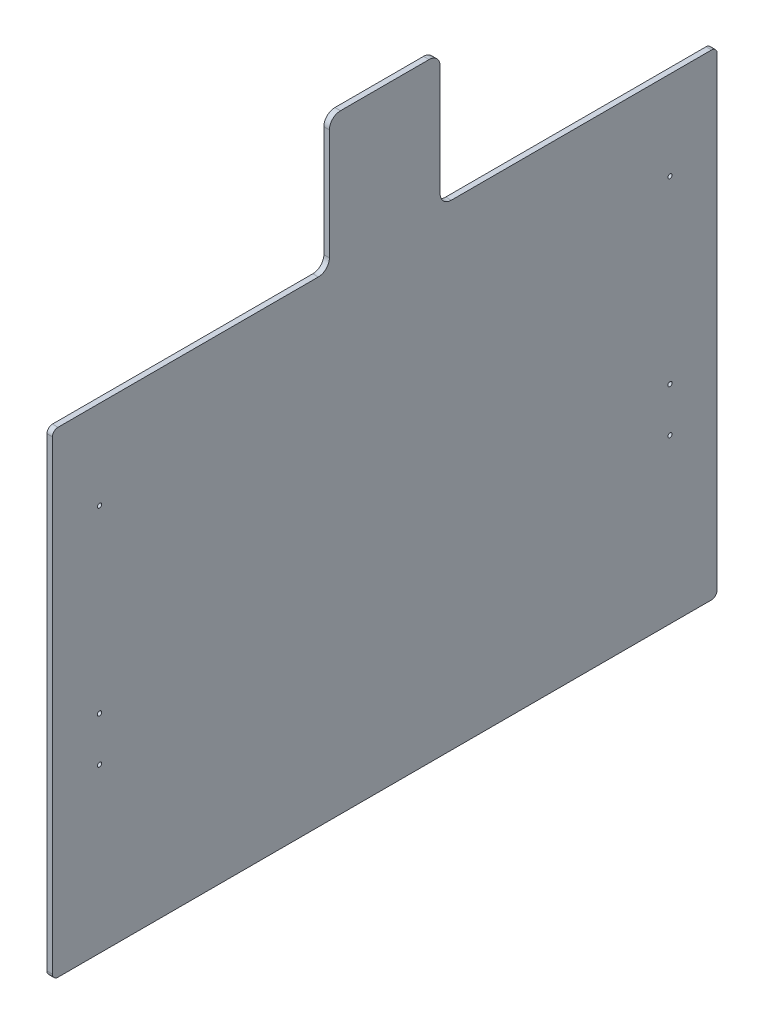
ISO-10303-21;
HEADER;
FILE_DESCRIPTION(('STEP AP214'),'2;1');
FILE_NAME('part.step','',(''),(''),'','','');
FILE_SCHEMA(('AUTOMOTIVE_DESIGN { 1 0 10303 214 1 1 1 1 }'));
ENDSEC;
DATA;
#1=APPLICATION_CONTEXT('core data for automotive mechanical design processes');
#2=APPLICATION_PROTOCOL_DEFINITION('international standard','automotive_design',2000,#1);
#3=PRODUCT_CONTEXT('',#1,'mechanical');
#4=PRODUCT('Part','Part','',(#3));
#5=PRODUCT_RELATED_PRODUCT_CATEGORY('part','',(#4));
#6=PRODUCT_DEFINITION_FORMATION('','',#4);
#7=PRODUCT_DEFINITION_CONTEXT('part definition',#1,'design');
#8=PRODUCT_DEFINITION('design','',#6,#7);
#9=PRODUCT_DEFINITION_SHAPE('','',#8);
#10=(LENGTH_UNIT() NAMED_UNIT(*) SI_UNIT(.MILLI.,.METRE.));
#11=(NAMED_UNIT(*) PLANE_ANGLE_UNIT() SI_UNIT($,.RADIAN.));
#12=(NAMED_UNIT(*) SI_UNIT($,.STERADIAN.) SOLID_ANGLE_UNIT());
#13=UNCERTAINTY_MEASURE_WITH_UNIT(LENGTH_MEASURE(1.E-05),#10,'distance_accuracy_value','');
#14=(GEOMETRIC_REPRESENTATION_CONTEXT(3) GLOBAL_UNCERTAINTY_ASSIGNED_CONTEXT((#13)) GLOBAL_UNIT_ASSIGNED_CONTEXT((#10,
#11,#12)) REPRESENTATION_CONTEXT('',''));
#15=CARTESIAN_POINT('',(0.,0.,0.));
#16=DIRECTION('',(0.,0.,1.));
#17=DIRECTION('',(1.,0.,0.));
#18=AXIS2_PLACEMENT_3D('',#15,#16,#17);
#19=CARTESIAN_POINT('',(6.35,6.35,-6.35));
#20=DIRECTION('',(-1.,0.,0.));
#21=DIRECTION('',(0.,0.,1.));
#22=AXIS2_PLACEMENT_3D('',#19,#20,#21);
#23=PLANE('',#22);
#24=CARTESIAN_POINT('',(6.35,6.35,-6.35));
#25=DIRECTION('',(1.,0.,0.));
#26=DIRECTION('',(0.,0.,1.));
#27=AXIS2_PLACEMENT_3D('',#24,#25,#26);
#28=CIRCLE('',#27,6.35);
#29=CARTESIAN_POINT('',(6.35,6.35000000000004,0.));
#30=VERTEX_POINT('',#29);
#31=CARTESIAN_POINT('',(6.35,0.,-6.35000000000004));
#32=VERTEX_POINT('',#31);
#33=EDGE_CURVE('E213',#30,#32,#28,.T.);
#34=ORIENTED_EDGE('',*,*,#33,.T.);
#35=DIRECTION('',(0.,0.,-1.));
#36=VECTOR('',#35,1.);
#37=CARTESIAN_POINT('',(6.35,0.,-6.35000000000004));
#38=LINE('',#37,#36);
#39=CARTESIAN_POINT('',(6.35,0.,-755.65));
#40=VERTEX_POINT('',#39);
#41=EDGE_CURVE('E121',#32,#40,#38,.T.);
#42=ORIENTED_EDGE('',*,*,#41,.T.);
#43=CARTESIAN_POINT('',(6.35,6.35,-755.65));
#44=DIRECTION('',(1.,0.,0.));
#45=DIRECTION('',(0.,0.,-1.));
#46=AXIS2_PLACEMENT_3D('',#43,#44,#45);
#47=CIRCLE('',#46,6.34999999999998);
#48=CARTESIAN_POINT('',(6.35,6.35,-762.));
#49=VERTEX_POINT('',#48);
#50=EDGE_CURVE('E252',#40,#49,#47,.T.);
#51=ORIENTED_EDGE('',*,*,#50,.T.);
#52=DIRECTION('',(0.,1.,0.));
#53=VECTOR('',#52,1.);
#54=CARTESIAN_POINT('',(6.35,6.35000000000004,-762.));
#55=LINE('',#54,#53);
#56=CARTESIAN_POINT('',(6.35,539.75,-762.));
#57=VERTEX_POINT('',#56);
#58=EDGE_CURVE('E271',#49,#57,#55,.T.);
#59=ORIENTED_EDGE('',*,*,#58,.T.);
#60=CARTESIAN_POINT('',(6.35,539.75,-755.65));
#61=DIRECTION('',(1.,0.,0.));
#62=DIRECTION('',(0.,0.,1.));
#63=AXIS2_PLACEMENT_3D('',#60,#61,#62);
#64=CIRCLE('',#63,6.34999999999997);
#65=CARTESIAN_POINT('',(6.35,546.1,-755.65));
#66=VERTEX_POINT('',#65);
#67=EDGE_CURVE('E268',#57,#66,#64,.T.);
#68=ORIENTED_EDGE('',*,*,#67,.T.);
#69=DIRECTION('',(0.,0.,1.));
#70=VECTOR('',#69,1.);
#71=CARTESIAN_POINT('',(6.35,546.1,-457.2));
#72=LINE('',#71,#70);
#73=CARTESIAN_POINT('',(6.35,546.1,-457.2));
#74=VERTEX_POINT('',#73);
#75=EDGE_CURVE('E270',#66,#74,#72,.T.);
#76=ORIENTED_EDGE('',*,*,#75,.T.);
#77=CARTESIAN_POINT('',(6.35,558.8,-457.2));
#78=DIRECTION('',(-1.,0.,0.));
#79=DIRECTION('',(0.,0.,1.));
#80=AXIS2_PLACEMENT_3D('',#77,#78,#79);
#81=CIRCLE('',#80,12.7);
#82=CARTESIAN_POINT('',(6.35,558.8,-444.5));
#83=VERTEX_POINT('',#82);
#84=EDGE_CURVE('E273',#74,#83,#81,.T.);
#85=ORIENTED_EDGE('',*,*,#84,.T.);
#86=DIRECTION('',(0.,1.,0.));
#87=VECTOR('',#86,1.);
#88=CARTESIAN_POINT('',(6.35,558.8,-444.5));
#89=LINE('',#88,#87);
#90=CARTESIAN_POINT('',(6.35,685.8,-444.5));
#91=VERTEX_POINT('',#90);
#92=EDGE_CURVE('E279',#83,#91,#89,.T.);
#93=ORIENTED_EDGE('',*,*,#92,.T.);
#94=CARTESIAN_POINT('',(6.35,685.8,-431.8));
#95=DIRECTION('',(1.,0.,0.));
#96=DIRECTION('',(0.,0.,1.));
#97=AXIS2_PLACEMENT_3D('',#94,#95,#96);
#98=CIRCLE('',#97,12.7);
#99=CARTESIAN_POINT('',(6.35,698.5,-431.8));
#100=VERTEX_POINT('',#99);
#101=EDGE_CURVE('E281',#91,#100,#98,.T.);
#102=ORIENTED_EDGE('',*,*,#101,.T.);
#103=DIRECTION('',(0.,0.,1.));
#104=VECTOR('',#103,1.);
#105=CARTESIAN_POINT('',(6.35,698.5,-330.2));
#106=LINE('',#105,#104);
#107=CARTESIAN_POINT('',(6.35,698.5,-330.2));
#108=VERTEX_POINT('',#107);
#109=EDGE_CURVE('E283',#100,#108,#106,.T.);
#110=ORIENTED_EDGE('',*,*,#109,.T.);
#111=CARTESIAN_POINT('',(6.35,685.8,-330.2));
#112=DIRECTION('',(1.,0.,0.));
#113=DIRECTION('',(0.,0.,1.));
#114=AXIS2_PLACEMENT_3D('',#111,#112,#113);
#115=CIRCLE('',#114,12.7);
#116=CARTESIAN_POINT('',(6.35,685.8,-317.5));
#117=VERTEX_POINT('',#116);
#118=EDGE_CURVE('E285',#108,#117,#115,.T.);
#119=ORIENTED_EDGE('',*,*,#118,.T.);
#120=DIRECTION('',(0.,-1.,0.));
#121=VECTOR('',#120,1.);
#122=CARTESIAN_POINT('',(6.35,558.8,-317.5));
#123=LINE('',#122,#121);
#124=CARTESIAN_POINT('',(6.35,558.8,-317.5));
#125=VERTEX_POINT('',#124);
#126=EDGE_CURVE('E287',#117,#125,#123,.T.);
#127=ORIENTED_EDGE('',*,*,#126,.T.);
#128=CARTESIAN_POINT('',(6.35,558.8,-304.8));
#129=DIRECTION('',(-1.,0.,0.));
#130=DIRECTION('',(0.,0.,-1.));
#131=AXIS2_PLACEMENT_3D('',#128,#129,#130);
#132=CIRCLE('',#131,12.7);
#133=CARTESIAN_POINT('',(6.35,546.1,-304.8));
#134=VERTEX_POINT('',#133);
#135=EDGE_CURVE('E164',#125,#134,#132,.T.);
#136=ORIENTED_EDGE('',*,*,#135,.T.);
#137=DIRECTION('',(0.,0.,1.));
#138=VECTOR('',#137,1.);
#139=CARTESIAN_POINT('',(6.35,546.1,-6.35));
#140=LINE('',#139,#138);
#141=CARTESIAN_POINT('',(6.35,546.1,-6.35));
#142=VERTEX_POINT('',#141);
#143=EDGE_CURVE('E158',#134,#142,#140,.T.);
#144=ORIENTED_EDGE('',*,*,#143,.T.);
#145=CARTESIAN_POINT('',(6.35,539.75,-6.35));
#146=DIRECTION('',(1.,0.,0.));
#147=DIRECTION('',(0.,0.,1.));
#148=AXIS2_PLACEMENT_3D('',#145,#146,#147);
#149=CIRCLE('',#148,6.34999999999998);
#150=CARTESIAN_POINT('',(6.35,539.75,0.));
#151=VERTEX_POINT('',#150);
#152=EDGE_CURVE('E162',#142,#151,#149,.T.);
#153=ORIENTED_EDGE('',*,*,#152,.T.);
#154=DIRECTION('',(0.,-1.,0.));
#155=VECTOR('',#154,1.);
#156=CARTESIAN_POINT('',(6.35,6.35000000000004,0.));
#157=LINE('',#156,#155);
#158=EDGE_CURVE('E54',#151,#30,#157,.T.);
#159=ORIENTED_EDGE('',*,*,#158,.T.);
#160=EDGE_LOOP('',(#34,#42,#51,#59,#68,#76,#85,#93,#102,#110,#119,#127,#136,#144,#153,#159));
#161=FACE_BOUND('',#160,.T.);
#162=CARTESIAN_POINT('',(6.35,444.5,-53.975));
#163=DIRECTION('',(1.,0.,0.));
#164=DIRECTION('',(0.,0.,-1.));
#165=AXIS2_PLACEMENT_3D('',#162,#163,#164);
#166=CIRCLE('',#165,2.45745000000002);
#167=CARTESIAN_POINT('',(6.35,444.5,-56.43245));
#168=VERTEX_POINT('',#167);
#169=EDGE_CURVE('E186',#168,#168,#166,.T.);
#170=ORIENTED_EDGE('',*,*,#169,.F.);
#171=EDGE_LOOP('',(#170));
#172=FACE_BOUND('',#171,.T.);
#173=CARTESIAN_POINT('',(6.35,187.325,-53.975));
#174=DIRECTION('',(1.,0.,0.));
#175=DIRECTION('',(0.,0.,-1.));
#176=AXIS2_PLACEMENT_3D('',#173,#174,#175);
#177=CIRCLE('',#176,2.45745);
#178=CARTESIAN_POINT('',(6.35,187.325,-56.43245));
#179=VERTEX_POINT('',#178);
#180=EDGE_CURVE('E371',#179,#179,#177,.T.);
#181=ORIENTED_EDGE('',*,*,#180,.F.);
#182=EDGE_LOOP('',(#181));
#183=FACE_BOUND('',#182,.T.);
#184=CARTESIAN_POINT('',(6.35,444.5,-708.025));
#185=DIRECTION('',(1.,0.,0.));
#186=DIRECTION('',(0.,0.,-1.));
#187=AXIS2_PLACEMENT_3D('',#184,#185,#186);
#188=CIRCLE('',#187,2.45745);
#189=CARTESIAN_POINT('',(6.35,444.5,-710.48245));
#190=VERTEX_POINT('',#189);
#191=EDGE_CURVE('E365',#190,#190,#188,.T.);
#192=ORIENTED_EDGE('',*,*,#191,.F.);
#193=EDGE_LOOP('',(#192));
#194=FACE_BOUND('',#193,.T.);
#195=CARTESIAN_POINT('',(6.35,238.125,-708.025));
#196=DIRECTION('',(1.,0.,0.));
#197=DIRECTION('',(0.,0.,-1.));
#198=AXIS2_PLACEMENT_3D('',#195,#196,#197);
#199=CIRCLE('',#198,2.45745000000001);
#200=CARTESIAN_POINT('',(6.35,238.125,-710.48245));
#201=VERTEX_POINT('',#200);
#202=EDGE_CURVE('E359',#201,#201,#199,.T.);
#203=ORIENTED_EDGE('',*,*,#202,.F.);
#204=EDGE_LOOP('',(#203));
#205=FACE_BOUND('',#204,.T.);
#206=CARTESIAN_POINT('',(6.35,187.325,-708.025));
#207=DIRECTION('',(1.,0.,0.));
#208=DIRECTION('',(0.,0.,-1.));
#209=AXIS2_PLACEMENT_3D('',#206,#207,#208);
#210=CIRCLE('',#209,2.45745000000001);
#211=CARTESIAN_POINT('',(6.35,187.325,-710.48245));
#212=VERTEX_POINT('',#211);
#213=EDGE_CURVE('E353',#212,#212,#210,.T.);
#214=ORIENTED_EDGE('',*,*,#213,.F.);
#215=EDGE_LOOP('',(#214));
#216=FACE_BOUND('',#215,.T.);
#217=CARTESIAN_POINT('',(6.35,238.125,-53.975));
#218=DIRECTION('',(1.,0.,0.));
#219=DIRECTION('',(0.,0.,-1.));
#220=AXIS2_PLACEMENT_3D('',#217,#218,#219);
#221=CIRCLE('',#220,2.45745);
#222=CARTESIAN_POINT('',(6.35,238.125,-56.43245));
#223=VERTEX_POINT('',#222);
#224=EDGE_CURVE('E344',#223,#223,#221,.T.);
#225=ORIENTED_EDGE('',*,*,#224,.F.);
#226=EDGE_LOOP('',(#225));
#227=FACE_BOUND('',#226,.T.);
#228=ADVANCED_FACE('F37',(#161,#172,#183,#194,#205,#216,#227),#23,.F.);
#229=CARTESIAN_POINT('',(0.,6.35,-6.35));
#230=DIRECTION('',(-1.,0.,0.));
#231=DIRECTION('',(0.,0.,1.));
#232=AXIS2_PLACEMENT_3D('',#229,#230,#231);
#233=PLANE('',#232);
#234=CARTESIAN_POINT('',(0.,187.325,-708.025));
#235=DIRECTION('',(1.,0.,0.));
#236=DIRECTION('',(0.,0.,-1.));
#237=AXIS2_PLACEMENT_3D('',#234,#235,#236);
#238=CIRCLE('',#237,2.45745000000001);
#239=CARTESIAN_POINT('',(0.,187.325,-710.48245));
#240=VERTEX_POINT('',#239);
#241=EDGE_CURVE('E350',#240,#240,#238,.T.);
#242=ORIENTED_EDGE('',*,*,#241,.T.);
#243=EDGE_LOOP('',(#242));
#244=FACE_BOUND('',#243,.T.);
#245=CARTESIAN_POINT('',(0.,444.5,-708.025));
#246=DIRECTION('',(1.,0.,0.));
#247=DIRECTION('',(0.,0.,-1.));
#248=AXIS2_PLACEMENT_3D('',#245,#246,#247);
#249=CIRCLE('',#248,2.45745);
#250=CARTESIAN_POINT('',(0.,444.5,-710.48245));
#251=VERTEX_POINT('',#250);
#252=EDGE_CURVE('E362',#251,#251,#249,.T.);
#253=ORIENTED_EDGE('',*,*,#252,.T.);
#254=EDGE_LOOP('',(#253));
#255=FACE_BOUND('',#254,.T.);
#256=CARTESIAN_POINT('',(0.,444.5,-53.975));
#257=DIRECTION('',(1.,0.,0.));
#258=DIRECTION('',(0.,0.,-1.));
#259=AXIS2_PLACEMENT_3D('',#256,#257,#258);
#260=CIRCLE('',#259,2.45745000000002);
#261=CARTESIAN_POINT('',(0.,444.5,-56.43245));
#262=VERTEX_POINT('',#261);
#263=EDGE_CURVE('E374',#262,#262,#260,.T.);
#264=ORIENTED_EDGE('',*,*,#263,.T.);
#265=EDGE_LOOP('',(#264));
#266=FACE_BOUND('',#265,.T.);
#267=CARTESIAN_POINT('',(0.,6.35,-6.35));
#268=DIRECTION('',(1.,0.,0.));
#269=DIRECTION('',(0.,0.,1.));
#270=AXIS2_PLACEMENT_3D('',#267,#268,#269);
#271=CIRCLE('',#270,6.35);
#272=CARTESIAN_POINT('',(0.,6.35000000000004,0.));
#273=VERTEX_POINT('',#272);
#274=CARTESIAN_POINT('',(0.,0.,-6.35000000000004));
#275=VERTEX_POINT('',#274);
#276=EDGE_CURVE('E182',#273,#275,#271,.T.);
#277=ORIENTED_EDGE('',*,*,#276,.F.);
#278=DIRECTION('',(0.,-1.,0.));
#279=VECTOR('',#278,1.);
#280=CARTESIAN_POINT('',(0.,6.35000000000004,0.));
#281=LINE('',#280,#279);
#282=CARTESIAN_POINT('',(0.,539.75,0.));
#283=VERTEX_POINT('',#282);
#284=EDGE_CURVE('E113',#283,#273,#281,.T.);
#285=ORIENTED_EDGE('',*,*,#284,.F.);
#286=CARTESIAN_POINT('',(0.,539.75,-6.35));
#287=DIRECTION('',(1.,0.,0.));
#288=DIRECTION('',(0.,0.,1.));
#289=AXIS2_PLACEMENT_3D('',#286,#287,#288);
#290=CIRCLE('',#289,6.34999999999998);
#291=CARTESIAN_POINT('',(0.,546.1,-6.35));
#292=VERTEX_POINT('',#291);
#293=EDGE_CURVE('E107',#292,#283,#290,.T.);
#294=ORIENTED_EDGE('',*,*,#293,.F.);
#295=DIRECTION('',(0.,0.,1.));
#296=VECTOR('',#295,1.);
#297=CARTESIAN_POINT('',(0.,546.1,-6.35));
#298=LINE('',#297,#296);
#299=CARTESIAN_POINT('',(0.,546.1,-304.8));
#300=VERTEX_POINT('',#299);
#301=EDGE_CURVE('E172',#300,#292,#298,.T.);
#302=ORIENTED_EDGE('',*,*,#301,.F.);
#303=CARTESIAN_POINT('',(0.,558.8,-304.8));
#304=DIRECTION('',(-1.,0.,0.));
#305=DIRECTION('',(0.,0.,-1.));
#306=AXIS2_PLACEMENT_3D('',#303,#304,#305);
#307=CIRCLE('',#306,12.7);
#308=CARTESIAN_POINT('',(0.,558.8,-317.5));
#309=VERTEX_POINT('',#308);
#310=EDGE_CURVE('E208',#309,#300,#307,.T.);
#311=ORIENTED_EDGE('',*,*,#310,.F.);
#312=DIRECTION('',(0.,-1.,0.));
#313=VECTOR('',#312,1.);
#314=CARTESIAN_POINT('',(0.,558.8,-317.5));
#315=LINE('',#314,#313);
#316=CARTESIAN_POINT('',(0.,685.8,-317.5));
#317=VERTEX_POINT('',#316);
#318=EDGE_CURVE('E206',#317,#309,#315,.T.);
#319=ORIENTED_EDGE('',*,*,#318,.F.);
#320=CARTESIAN_POINT('',(0.,685.8,-330.2));
#321=DIRECTION('',(1.,0.,0.));
#322=DIRECTION('',(0.,0.,1.));
#323=AXIS2_PLACEMENT_3D('',#320,#321,#322);
#324=CIRCLE('',#323,12.7);
#325=CARTESIAN_POINT('',(0.,698.5,-330.2));
#326=VERTEX_POINT('',#325);
#327=EDGE_CURVE('E204',#326,#317,#324,.T.);
#328=ORIENTED_EDGE('',*,*,#327,.F.);
#329=DIRECTION('',(0.,0.,1.));
#330=VECTOR('',#329,1.);
#331=CARTESIAN_POINT('',(0.,698.5,-330.2));
#332=LINE('',#331,#330);
#333=CARTESIAN_POINT('',(0.,698.5,-431.8));
#334=VERTEX_POINT('',#333);
#335=EDGE_CURVE('E202',#334,#326,#332,.T.);
#336=ORIENTED_EDGE('',*,*,#335,.F.);
#337=CARTESIAN_POINT('',(0.,685.8,-431.8));
#338=DIRECTION('',(1.,0.,0.));
#339=DIRECTION('',(0.,0.,1.));
#340=AXIS2_PLACEMENT_3D('',#337,#338,#339);
#341=CIRCLE('',#340,12.7);
#342=CARTESIAN_POINT('',(0.,685.8,-444.5));
#343=VERTEX_POINT('',#342);
#344=EDGE_CURVE('E200',#343,#334,#341,.T.);
#345=ORIENTED_EDGE('',*,*,#344,.F.);
#346=DIRECTION('',(0.,1.,0.));
#347=VECTOR('',#346,1.);
#348=CARTESIAN_POINT('',(0.,558.8,-444.5));
#349=LINE('',#348,#347);
#350=CARTESIAN_POINT('',(0.,558.8,-444.5));
#351=VERTEX_POINT('',#350);
#352=EDGE_CURVE('E198',#351,#343,#349,.T.);
#353=ORIENTED_EDGE('',*,*,#352,.F.);
#354=CARTESIAN_POINT('',(0.,558.8,-457.2));
#355=DIRECTION('',(-1.,0.,0.));
#356=DIRECTION('',(0.,0.,1.));
#357=AXIS2_PLACEMENT_3D('',#354,#355,#356);
#358=CIRCLE('',#357,12.7);
#359=CARTESIAN_POINT('',(0.,546.1,-457.2));
#360=VERTEX_POINT('',#359);
#361=EDGE_CURVE('E196',#360,#351,#358,.T.);
#362=ORIENTED_EDGE('',*,*,#361,.F.);
#363=DIRECTION('',(0.,0.,1.));
#364=VECTOR('',#363,1.);
#365=CARTESIAN_POINT('',(0.,546.1,-457.2));
#366=LINE('',#365,#364);
#367=CARTESIAN_POINT('',(0.,546.1,-755.65));
#368=VERTEX_POINT('',#367);
#369=EDGE_CURVE('E194',#368,#360,#366,.T.);
#370=ORIENTED_EDGE('',*,*,#369,.F.);
#371=CARTESIAN_POINT('',(0.,539.75,-755.65));
#372=DIRECTION('',(1.,0.,0.));
#373=DIRECTION('',(0.,0.,1.));
#374=AXIS2_PLACEMENT_3D('',#371,#372,#373);
#375=CIRCLE('',#374,6.34999999999997);
#376=CARTESIAN_POINT('',(0.,539.75,-762.));
#377=VERTEX_POINT('',#376);
#378=EDGE_CURVE('E192',#377,#368,#375,.T.);
#379=ORIENTED_EDGE('',*,*,#378,.F.);
#380=DIRECTION('',(0.,1.,0.));
#381=VECTOR('',#380,1.);
#382=CARTESIAN_POINT('',(0.,6.35000000000004,-762.));
#383=LINE('',#382,#381);
#384=CARTESIAN_POINT('',(0.,6.35,-762.));
#385=VERTEX_POINT('',#384);
#386=EDGE_CURVE('E190',#385,#377,#383,.T.);
#387=ORIENTED_EDGE('',*,*,#386,.F.);
#388=CARTESIAN_POINT('',(0.,6.35,-755.65));
#389=DIRECTION('',(1.,0.,0.));
#390=DIRECTION('',(0.,0.,-1.));
#391=AXIS2_PLACEMENT_3D('',#388,#389,#390);
#392=CIRCLE('',#391,6.34999999999998);
#393=CARTESIAN_POINT('',(0.,0.,-755.65));
#394=VERTEX_POINT('',#393);
#395=EDGE_CURVE('E188',#394,#385,#392,.T.);
#396=ORIENTED_EDGE('',*,*,#395,.F.);
#397=DIRECTION('',(0.,0.,-1.));
#398=VECTOR('',#397,1.);
#399=CARTESIAN_POINT('',(0.,0.,-6.35000000000004));
#400=LINE('',#399,#398);
#401=EDGE_CURVE('E185',#275,#394,#400,.T.);
#402=ORIENTED_EDGE('',*,*,#401,.F.);
#403=EDGE_LOOP('',(#277,#285,#294,#302,#311,#319,#328,#336,#345,#353,#362,#370,#379,#387,#396,#402));
#404=FACE_BOUND('',#403,.T.);
#405=CARTESIAN_POINT('',(0.,187.325,-53.975));
#406=DIRECTION('',(1.,0.,0.));
#407=DIRECTION('',(0.,0.,-1.));
#408=AXIS2_PLACEMENT_3D('',#405,#406,#407);
#409=CIRCLE('',#408,2.45745);
#410=CARTESIAN_POINT('',(0.,187.325,-56.43245));
#411=VERTEX_POINT('',#410);
#412=EDGE_CURVE('E368',#411,#411,#409,.T.);
#413=ORIENTED_EDGE('',*,*,#412,.T.);
#414=EDGE_LOOP('',(#413));
#415=FACE_BOUND('',#414,.T.);
#416=CARTESIAN_POINT('',(0.,238.125,-708.025));
#417=DIRECTION('',(1.,0.,0.));
#418=DIRECTION('',(0.,0.,-1.));
#419=AXIS2_PLACEMENT_3D('',#416,#417,#418);
#420=CIRCLE('',#419,2.45745000000001);
#421=CARTESIAN_POINT('',(0.,238.125,-710.48245));
#422=VERTEX_POINT('',#421);
#423=EDGE_CURVE('E356',#422,#422,#420,.T.);
#424=ORIENTED_EDGE('',*,*,#423,.T.);
#425=EDGE_LOOP('',(#424));
#426=FACE_BOUND('',#425,.T.);
#427=CARTESIAN_POINT('',(0.,238.125,-53.975));
#428=DIRECTION('',(1.,0.,0.));
#429=DIRECTION('',(0.,0.,-1.));
#430=AXIS2_PLACEMENT_3D('',#427,#428,#429);
#431=CIRCLE('',#430,2.45745);
#432=CARTESIAN_POINT('',(0.,238.125,-56.43245));
#433=VERTEX_POINT('',#432);
#434=EDGE_CURVE('E347',#433,#433,#431,.T.);
#435=ORIENTED_EDGE('',*,*,#434,.T.);
#436=EDGE_LOOP('',(#435));
#437=FACE_BOUND('',#436,.T.);
#438=ADVANCED_FACE('F256',(#244,#255,#266,#404,#415,#426,#437),#233,.T.);
#439=CARTESIAN_POINT('',(6.35,6.35,-6.35));
#440=DIRECTION('',(-1.,0.,0.));
#441=DIRECTION('',(0.,0.,1.));
#442=AXIS2_PLACEMENT_3D('',#439,#440,#441);
#443=CYLINDRICAL_SURFACE('',#442,6.35);
#444=ORIENTED_EDGE('',*,*,#276,.T.);
#445=DIRECTION('',(-1.,0.,0.));
#446=VECTOR('',#445,1.);
#447=CARTESIAN_POINT('',(6.35,0.,-6.35000000000004));
#448=LINE('',#447,#446);
#449=EDGE_CURVE('E11',#32,#275,#448,.T.);
#450=ORIENTED_EDGE('',*,*,#449,.F.);
#451=ORIENTED_EDGE('',*,*,#33,.F.);
#452=DIRECTION('',(-1.,0.,0.));
#453=VECTOR('',#452,1.);
#454=CARTESIAN_POINT('',(6.35,6.35000000000004,0.));
#455=LINE('',#454,#453);
#456=EDGE_CURVE('E178',#30,#273,#455,.T.);
#457=ORIENTED_EDGE('',*,*,#456,.T.);
#458=EDGE_LOOP('',(#444,#450,#451,#457));
#459=FACE_BOUND('',#458,.T.);
#460=ADVANCED_FACE('F39',(#459),#443,.T.);
#461=CARTESIAN_POINT('',(6.35,0.,-6.35000000000004));
#462=DIRECTION('',(0.,1.,0.));
#463=DIRECTION('',(0.,0.,1.));
#464=AXIS2_PLACEMENT_3D('',#461,#462,#463);
#465=PLANE('',#464);
#466=ORIENTED_EDGE('',*,*,#401,.T.);
#467=DIRECTION('',(-1.,0.,0.));
#468=VECTOR('',#467,1.);
#469=CARTESIAN_POINT('',(6.35,0.,-755.65));
#470=LINE('',#469,#468);
#471=EDGE_CURVE('E46',#40,#394,#470,.T.);
#472=ORIENTED_EDGE('',*,*,#471,.F.);
#473=ORIENTED_EDGE('',*,*,#41,.F.);
#474=ORIENTED_EDGE('',*,*,#449,.T.);
#475=EDGE_LOOP('',(#466,#472,#473,#474));
#476=FACE_BOUND('',#475,.T.);
#477=ADVANCED_FACE('F558',(#476),#465,.F.);
#478=CARTESIAN_POINT('',(6.35,6.35,-755.65));
#479=DIRECTION('',(-1.,0.,0.));
#480=DIRECTION('',(0.,0.,1.));
#481=AXIS2_PLACEMENT_3D('',#478,#479,#480);
#482=CYLINDRICAL_SURFACE('',#481,6.34999999999998);
#483=ORIENTED_EDGE('',*,*,#395,.T.);
#484=DIRECTION('',(-1.,0.,0.));
#485=VECTOR('',#484,1.);
#486=CARTESIAN_POINT('',(6.35,6.35,-762.));
#487=LINE('',#486,#485);
#488=EDGE_CURVE('E244',#49,#385,#487,.T.);
#489=ORIENTED_EDGE('',*,*,#488,.F.);
#490=ORIENTED_EDGE('',*,*,#50,.F.);
#491=ORIENTED_EDGE('',*,*,#471,.T.);
#492=EDGE_LOOP('',(#483,#489,#490,#491));
#493=FACE_BOUND('',#492,.T.);
#494=ADVANCED_FACE('F250',(#493),#482,.T.);
#495=CARTESIAN_POINT('',(6.35,6.35000000000004,-762.));
#496=DIRECTION('',(0.,0.,1.));
#497=DIRECTION('',(1.,0.,0.));
#498=AXIS2_PLACEMENT_3D('',#495,#496,#497);
#499=PLANE('',#498);
#500=ORIENTED_EDGE('',*,*,#386,.T.);
#501=DIRECTION('',(-1.,0.,0.));
#502=VECTOR('',#501,1.);
#503=CARTESIAN_POINT('',(6.35,539.75,-762.));
#504=LINE('',#503,#502);
#505=EDGE_CURVE('E241',#57,#377,#504,.T.);
#506=ORIENTED_EDGE('',*,*,#505,.F.);
#507=ORIENTED_EDGE('',*,*,#58,.F.);
#508=ORIENTED_EDGE('',*,*,#488,.T.);
#509=EDGE_LOOP('',(#500,#506,#507,#508));
#510=FACE_BOUND('',#509,.T.);
#511=ADVANCED_FACE('F262',(#510),#499,.F.);
#512=CARTESIAN_POINT('',(6.35,539.75,-755.65));
#513=DIRECTION('',(-1.,0.,0.));
#514=DIRECTION('',(0.,0.,1.));
#515=AXIS2_PLACEMENT_3D('',#512,#513,#514);
#516=CYLINDRICAL_SURFACE('',#515,6.34999999999997);
#517=ORIENTED_EDGE('',*,*,#378,.T.);
#518=DIRECTION('',(-1.,0.,0.));
#519=VECTOR('',#518,1.);
#520=CARTESIAN_POINT('',(6.35,546.1,-755.65));
#521=LINE('',#520,#519);
#522=EDGE_CURVE('E238',#66,#368,#521,.T.);
#523=ORIENTED_EDGE('',*,*,#522,.F.);
#524=ORIENTED_EDGE('',*,*,#67,.F.);
#525=ORIENTED_EDGE('',*,*,#505,.T.);
#526=EDGE_LOOP('',(#517,#523,#524,#525));
#527=FACE_BOUND('',#526,.T.);
#528=ADVANCED_FACE('F266',(#527),#516,.T.);
#529=CARTESIAN_POINT('',(6.35,546.1,-457.2));
#530=DIRECTION('',(0.,-1.,0.));
#531=DIRECTION('',(0.,0.,-1.));
#532=AXIS2_PLACEMENT_3D('',#529,#530,#531);
#533=PLANE('',#532);
#534=ORIENTED_EDGE('',*,*,#369,.T.);
#535=DIRECTION('',(-1.,0.,0.));
#536=VECTOR('',#535,1.);
#537=CARTESIAN_POINT('',(6.35,546.1,-457.2));
#538=LINE('',#537,#536);
#539=EDGE_CURVE('E235',#74,#360,#538,.T.);
#540=ORIENTED_EDGE('',*,*,#539,.F.);
#541=ORIENTED_EDGE('',*,*,#75,.F.);
#542=ORIENTED_EDGE('',*,*,#522,.T.);
#543=EDGE_LOOP('',(#534,#540,#541,#542));
#544=FACE_BOUND('',#543,.T.);
#545=ADVANCED_FACE('F519',(#544),#533,.F.);
#546=CARTESIAN_POINT('',(6.35,558.8,-457.2));
#547=DIRECTION('',(-1.,0.,0.));
#548=DIRECTION('',(0.,0.,1.));
#549=AXIS2_PLACEMENT_3D('',#546,#547,#548);
#550=CYLINDRICAL_SURFACE('',#549,12.7);
#551=ORIENTED_EDGE('',*,*,#361,.T.);
#552=DIRECTION('',(-1.,0.,0.));
#553=VECTOR('',#552,1.);
#554=CARTESIAN_POINT('',(6.35,558.8,-444.5));
#555=LINE('',#554,#553);
#556=EDGE_CURVE('E232',#83,#351,#555,.T.);
#557=ORIENTED_EDGE('',*,*,#556,.F.);
#558=ORIENTED_EDGE('',*,*,#84,.F.);
#559=ORIENTED_EDGE('',*,*,#539,.T.);
#560=EDGE_LOOP('',(#551,#557,#558,#559));
#561=FACE_BOUND('',#560,.T.);
#562=ADVANCED_FACE('F508',(#561),#550,.F.);
#563=CARTESIAN_POINT('',(6.35,558.8,-444.5));
#564=DIRECTION('',(0.,0.,1.));
#565=DIRECTION('',(1.,0.,0.));
#566=AXIS2_PLACEMENT_3D('',#563,#564,#565);
#567=PLANE('',#566);
#568=ORIENTED_EDGE('',*,*,#352,.T.);
#569=DIRECTION('',(-1.,0.,0.));
#570=VECTOR('',#569,1.);
#571=CARTESIAN_POINT('',(6.35,685.8,-444.5));
#572=LINE('',#571,#570);
#573=EDGE_CURVE('E229',#91,#343,#572,.T.);
#574=ORIENTED_EDGE('',*,*,#573,.F.);
#575=ORIENTED_EDGE('',*,*,#92,.F.);
#576=ORIENTED_EDGE('',*,*,#556,.T.);
#577=EDGE_LOOP('',(#568,#574,#575,#576));
#578=FACE_BOUND('',#577,.T.);
#579=ADVANCED_FACE('F497',(#578),#567,.F.);
#580=CARTESIAN_POINT('',(6.35,685.8,-431.8));
#581=DIRECTION('',(-1.,0.,0.));
#582=DIRECTION('',(0.,0.,1.));
#583=AXIS2_PLACEMENT_3D('',#580,#581,#582);
#584=CYLINDRICAL_SURFACE('',#583,12.7);
#585=ORIENTED_EDGE('',*,*,#344,.T.);
#586=DIRECTION('',(-1.,0.,0.));
#587=VECTOR('',#586,1.);
#588=CARTESIAN_POINT('',(6.35,698.5,-431.8));
#589=LINE('',#588,#587);
#590=EDGE_CURVE('E226',#100,#334,#589,.T.);
#591=ORIENTED_EDGE('',*,*,#590,.F.);
#592=ORIENTED_EDGE('',*,*,#101,.F.);
#593=ORIENTED_EDGE('',*,*,#573,.T.);
#594=EDGE_LOOP('',(#585,#591,#592,#593));
#595=FACE_BOUND('',#594,.T.);
#596=ADVANCED_FACE('F486',(#595),#584,.T.);
#597=CARTESIAN_POINT('',(6.35,698.5,-330.2));
#598=DIRECTION('',(0.,-1.,0.));
#599=DIRECTION('',(0.,0.,-1.));
#600=AXIS2_PLACEMENT_3D('',#597,#598,#599);
#601=PLANE('',#600);
#602=ORIENTED_EDGE('',*,*,#335,.T.);
#603=DIRECTION('',(-1.,0.,0.));
#604=VECTOR('',#603,1.);
#605=CARTESIAN_POINT('',(6.35,698.5,-330.2));
#606=LINE('',#605,#604);
#607=EDGE_CURVE('E223',#108,#326,#606,.T.);
#608=ORIENTED_EDGE('',*,*,#607,.F.);
#609=ORIENTED_EDGE('',*,*,#109,.F.);
#610=ORIENTED_EDGE('',*,*,#590,.T.);
#611=EDGE_LOOP('',(#602,#608,#609,#610));
#612=FACE_BOUND('',#611,.T.);
#613=ADVANCED_FACE('F475',(#612),#601,.F.);
#614=CARTESIAN_POINT('',(6.35,685.8,-330.2));
#615=DIRECTION('',(-1.,0.,0.));
#616=DIRECTION('',(0.,0.,1.));
#617=AXIS2_PLACEMENT_3D('',#614,#615,#616);
#618=CYLINDRICAL_SURFACE('',#617,12.7);
#619=ORIENTED_EDGE('',*,*,#327,.T.);
#620=DIRECTION('',(-1.,0.,0.));
#621=VECTOR('',#620,1.);
#622=CARTESIAN_POINT('',(6.35,685.8,-317.5));
#623=LINE('',#622,#621);
#624=EDGE_CURVE('E220',#117,#317,#623,.T.);
#625=ORIENTED_EDGE('',*,*,#624,.F.);
#626=ORIENTED_EDGE('',*,*,#118,.F.);
#627=ORIENTED_EDGE('',*,*,#607,.T.);
#628=EDGE_LOOP('',(#619,#625,#626,#627));
#629=FACE_BOUND('',#628,.T.);
#630=ADVANCED_FACE('F465',(#629),#618,.T.);
#631=CARTESIAN_POINT('',(6.35,558.8,-317.5));
#632=DIRECTION('',(0.,0.,-1.));
#633=DIRECTION('',(-1.,0.,0.));
#634=AXIS2_PLACEMENT_3D('',#631,#632,#633);
#635=PLANE('',#634);
#636=ORIENTED_EDGE('',*,*,#318,.T.);
#637=DIRECTION('',(-1.,0.,0.));
#638=VECTOR('',#637,1.);
#639=CARTESIAN_POINT('',(6.35,558.8,-317.5));
#640=LINE('',#639,#638);
#641=EDGE_CURVE('E217',#125,#309,#640,.T.);
#642=ORIENTED_EDGE('',*,*,#641,.F.);
#643=ORIENTED_EDGE('',*,*,#126,.F.);
#644=ORIENTED_EDGE('',*,*,#624,.T.);
#645=EDGE_LOOP('',(#636,#642,#643,#644));
#646=FACE_BOUND('',#645,.T.);
#647=ADVANCED_FACE('F293',(#646),#635,.F.);
#648=CARTESIAN_POINT('',(6.35,558.8,-304.8));
#649=DIRECTION('',(-1.,0.,0.));
#650=DIRECTION('',(0.,0.,1.));
#651=AXIS2_PLACEMENT_3D('',#648,#649,#650);
#652=CYLINDRICAL_SURFACE('',#651,12.7);
#653=ORIENTED_EDGE('',*,*,#310,.T.);
#654=DIRECTION('',(-1.,0.,0.));
#655=VECTOR('',#654,1.);
#656=CARTESIAN_POINT('',(6.35,546.1,-304.8));
#657=LINE('',#656,#655);
#658=EDGE_CURVE('E173',#134,#300,#657,.T.);
#659=ORIENTED_EDGE('',*,*,#658,.F.);
#660=ORIENTED_EDGE('',*,*,#135,.F.);
#661=ORIENTED_EDGE('',*,*,#641,.T.);
#662=EDGE_LOOP('',(#653,#659,#660,#661));
#663=FACE_BOUND('',#662,.T.);
#664=ADVANCED_FACE('F297',(#663),#652,.F.);
#665=CARTESIAN_POINT('',(6.35,546.1,-6.35));
#666=DIRECTION('',(0.,-1.,0.));
#667=DIRECTION('',(0.,0.,-1.));
#668=AXIS2_PLACEMENT_3D('',#665,#666,#667);
#669=PLANE('',#668);
#670=ORIENTED_EDGE('',*,*,#301,.T.);
#671=DIRECTION('',(-1.,0.,0.));
#672=VECTOR('',#671,1.);
#673=CARTESIAN_POINT('',(6.35,546.1,-6.35));
#674=LINE('',#673,#672);
#675=EDGE_CURVE('E169',#142,#292,#674,.T.);
#676=ORIENTED_EDGE('',*,*,#675,.F.);
#677=ORIENTED_EDGE('',*,*,#143,.F.);
#678=ORIENTED_EDGE('',*,*,#658,.T.);
#679=EDGE_LOOP('',(#670,#676,#677,#678));
#680=FACE_BOUND('',#679,.T.);
#681=ADVANCED_FACE('F170',(#680),#669,.F.);
#682=CARTESIAN_POINT('',(6.35,539.75,-6.35));
#683=DIRECTION('',(-1.,0.,0.));
#684=DIRECTION('',(0.,0.,1.));
#685=AXIS2_PLACEMENT_3D('',#682,#683,#684);
#686=CYLINDRICAL_SURFACE('',#685,6.34999999999998);
#687=ORIENTED_EDGE('',*,*,#293,.T.);
#688=DIRECTION('',(-1.,0.,0.));
#689=VECTOR('',#688,1.);
#690=CARTESIAN_POINT('',(6.35,539.75,0.));
#691=LINE('',#690,#689);
#692=EDGE_CURVE('E174',#151,#283,#691,.T.);
#693=ORIENTED_EDGE('',*,*,#692,.F.);
#694=ORIENTED_EDGE('',*,*,#152,.F.);
#695=ORIENTED_EDGE('',*,*,#675,.T.);
#696=EDGE_LOOP('',(#687,#693,#694,#695));
#697=FACE_BOUND('',#696,.T.);
#698=ADVANCED_FACE('F176',(#697),#686,.T.);
#699=CARTESIAN_POINT('',(6.35,6.35000000000004,0.));
#700=DIRECTION('',(0.,0.,-1.));
#701=DIRECTION('',(-1.,0.,0.));
#702=AXIS2_PLACEMENT_3D('',#699,#700,#701);
#703=PLANE('',#702);
#704=ORIENTED_EDGE('',*,*,#284,.T.);
#705=ORIENTED_EDGE('',*,*,#456,.F.);
#706=ORIENTED_EDGE('',*,*,#158,.F.);
#707=ORIENTED_EDGE('',*,*,#692,.T.);
#708=EDGE_LOOP('',(#704,#705,#706,#707));
#709=FACE_BOUND('',#708,.T.);
#710=ADVANCED_FACE('F301',(#709),#703,.F.);
#711=CARTESIAN_POINT('',(6.35,444.5,-53.975));
#712=DIRECTION('',(-1.,0.,0.));
#713=DIRECTION('',(0.,0.,1.));
#714=AXIS2_PLACEMENT_3D('',#711,#712,#713);
#715=CYLINDRICAL_SURFACE('',#714,2.45745000000002);
#716=ORIENTED_EDGE('',*,*,#169,.T.);
#717=EDGE_LOOP('',(#716));
#718=FACE_BOUND('',#717,.T.);
#719=ORIENTED_EDGE('',*,*,#263,.F.);
#720=EDGE_LOOP('',(#719));
#721=FACE_BOUND('',#720,.T.);
#722=ADVANCED_FACE('F303',(#718,#721),#715,.F.);
#723=CARTESIAN_POINT('',(6.35,187.325,-53.975));
#724=DIRECTION('',(-1.,0.,0.));
#725=DIRECTION('',(0.,0.,1.));
#726=AXIS2_PLACEMENT_3D('',#723,#724,#725);
#727=CYLINDRICAL_SURFACE('',#726,2.45745);
#728=ORIENTED_EDGE('',*,*,#180,.T.);
#729=EDGE_LOOP('',(#728));
#730=FACE_BOUND('',#729,.T.);
#731=ORIENTED_EDGE('',*,*,#412,.F.);
#732=EDGE_LOOP('',(#731));
#733=FACE_BOUND('',#732,.T.);
#734=ADVANCED_FACE('F309',(#730,#733),#727,.F.);
#735=CARTESIAN_POINT('',(6.35,444.5,-708.025));
#736=DIRECTION('',(-1.,0.,0.));
#737=DIRECTION('',(0.,0.,1.));
#738=AXIS2_PLACEMENT_3D('',#735,#736,#737);
#739=CYLINDRICAL_SURFACE('',#738,2.45745);
#740=ORIENTED_EDGE('',*,*,#191,.T.);
#741=EDGE_LOOP('',(#740));
#742=FACE_BOUND('',#741,.T.);
#743=ORIENTED_EDGE('',*,*,#252,.F.);
#744=EDGE_LOOP('',(#743));
#745=FACE_BOUND('',#744,.T.);
#746=ADVANCED_FACE('F323',(#742,#745),#739,.F.);
#747=CARTESIAN_POINT('',(6.35,238.125,-708.025));
#748=DIRECTION('',(-1.,0.,0.));
#749=DIRECTION('',(0.,0.,1.));
#750=AXIS2_PLACEMENT_3D('',#747,#748,#749);
#751=CYLINDRICAL_SURFACE('',#750,2.45745000000001);
#752=ORIENTED_EDGE('',*,*,#202,.T.);
#753=EDGE_LOOP('',(#752));
#754=FACE_BOUND('',#753,.T.);
#755=ORIENTED_EDGE('',*,*,#423,.F.);
#756=EDGE_LOOP('',(#755));
#757=FACE_BOUND('',#756,.T.);
#758=ADVANCED_FACE('F327',(#754,#757),#751,.F.);
#759=CARTESIAN_POINT('',(6.35,187.325,-708.025));
#760=DIRECTION('',(-1.,0.,0.));
#761=DIRECTION('',(0.,0.,1.));
#762=AXIS2_PLACEMENT_3D('',#759,#760,#761);
#763=CYLINDRICAL_SURFACE('',#762,2.45745000000001);
#764=ORIENTED_EDGE('',*,*,#213,.T.);
#765=EDGE_LOOP('',(#764));
#766=FACE_BOUND('',#765,.T.);
#767=ORIENTED_EDGE('',*,*,#241,.F.);
#768=EDGE_LOOP('',(#767));
#769=FACE_BOUND('',#768,.T.);
#770=ADVANCED_FACE('F331',(#766,#769),#763,.F.);
#771=CARTESIAN_POINT('',(6.35,238.125,-53.975));
#772=DIRECTION('',(-1.,0.,0.));
#773=DIRECTION('',(0.,0.,1.));
#774=AXIS2_PLACEMENT_3D('',#771,#772,#773);
#775=CYLINDRICAL_SURFACE('',#774,2.45745);
#776=ORIENTED_EDGE('',*,*,#224,.T.);
#777=EDGE_LOOP('',(#776));
#778=FACE_BOUND('',#777,.T.);
#779=ORIENTED_EDGE('',*,*,#434,.F.);
#780=EDGE_LOOP('',(#779));
#781=FACE_BOUND('',#780,.T.);
#782=ADVANCED_FACE('F335',(#778,#781),#775,.F.);
#783=CLOSED_SHELL('',(#228,#438,#460,#477,#494,#511,#528,#545,#562,#579,#596,#613,#630,#647,
#664,#681,#698,#710,#722,#734,#746,#758,#770,#782));
#784=MANIFOLD_SOLID_BREP('B2',#783);
#785=ADVANCED_BREP_SHAPE_REPRESENTATION('',(#18,#784),#14);
#786=SHAPE_DEFINITION_REPRESENTATION(#9,#785);
ENDSEC;
END-ISO-10303-21;
